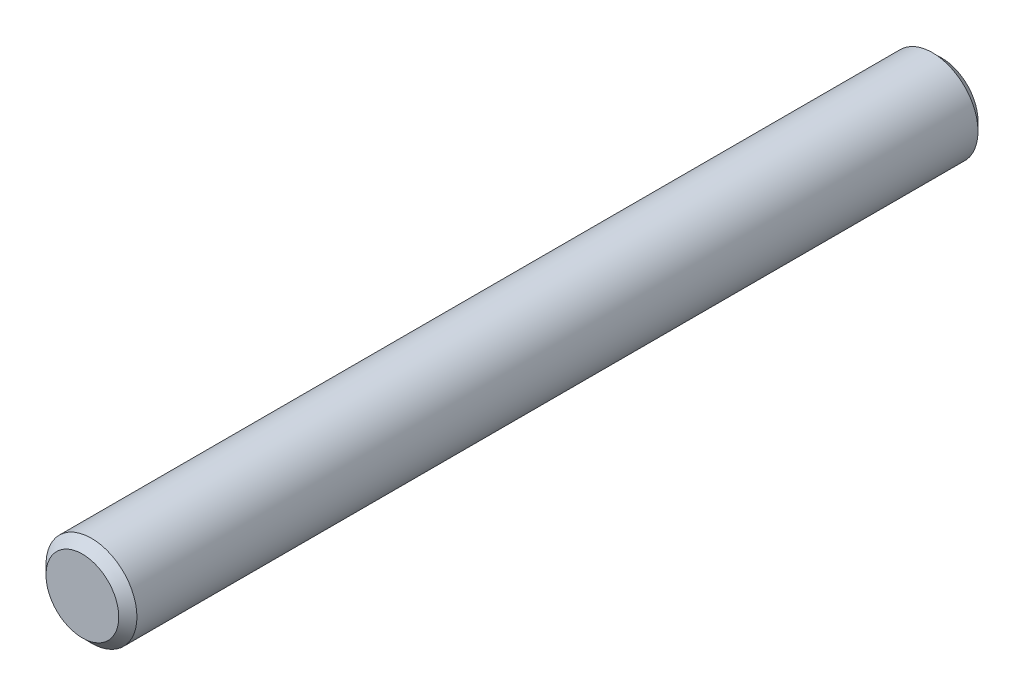
ISO-10303-21;
HEADER;
FILE_DESCRIPTION(('STEP AP214'),'2;1');
FILE_NAME('part.step','',(''),(''),'','','');
FILE_SCHEMA(('AUTOMOTIVE_DESIGN { 1 0 10303 214 1 1 1 1 }'));
ENDSEC;
DATA;
#1=APPLICATION_CONTEXT('core data for automotive mechanical design processes');
#2=APPLICATION_PROTOCOL_DEFINITION('international standard','automotive_design',2000,#1);
#3=PRODUCT_CONTEXT('',#1,'mechanical');
#4=PRODUCT('Part','Part','',(#3));
#5=PRODUCT_RELATED_PRODUCT_CATEGORY('part','',(#4));
#6=PRODUCT_DEFINITION_FORMATION('','',#4);
#7=PRODUCT_DEFINITION_CONTEXT('part definition',#1,'design');
#8=PRODUCT_DEFINITION('design','',#6,#7);
#9=PRODUCT_DEFINITION_SHAPE('','',#8);
#10=(LENGTH_UNIT() NAMED_UNIT(*) SI_UNIT(.MILLI.,.METRE.));
#11=(NAMED_UNIT(*) PLANE_ANGLE_UNIT() SI_UNIT($,.RADIAN.));
#12=(NAMED_UNIT(*) SI_UNIT($,.STERADIAN.) SOLID_ANGLE_UNIT());
#13=UNCERTAINTY_MEASURE_WITH_UNIT(LENGTH_MEASURE(1.E-05),#10,'distance_accuracy_value','');
#14=(GEOMETRIC_REPRESENTATION_CONTEXT(3) GLOBAL_UNCERTAINTY_ASSIGNED_CONTEXT((#13)) GLOBAL_UNIT_ASSIGNED_CONTEXT((#10,
#11,#12)) REPRESENTATION_CONTEXT('',''));
#15=CARTESIAN_POINT('',(0.,0.,0.));
#16=DIRECTION('',(0.,0.,1.));
#17=DIRECTION('',(1.,0.,0.));
#18=AXIS2_PLACEMENT_3D('',#15,#16,#17);
#19=CARTESIAN_POINT('',(0.,0.,75.));
#20=DIRECTION('',(0.,0.,-1.));
#21=DIRECTION('',(-1.,0.,0.));
#22=AXIS2_PLACEMENT_3D('',#19,#20,#21);
#23=CYLINDRICAL_SURFACE('',#22,7.9375);
#24=CARTESIAN_POINT('',(0.,0.,-73.4125));
#25=DIRECTION('',(0.,0.,1.));
#26=DIRECTION('',(1.,0.,0.));
#27=AXIS2_PLACEMENT_3D('',#24,#25,#26);
#28=CIRCLE('',#27,7.9375);
#29=CARTESIAN_POINT('',(7.9375,0.,-73.4125));
#30=VERTEX_POINT('',#29);
#31=EDGE_CURVE('E53',#30,#30,#28,.T.);
#32=ORIENTED_EDGE('',*,*,#31,.T.);
#33=EDGE_LOOP('',(#32));
#34=FACE_BOUND('',#33,.T.);
#35=CARTESIAN_POINT('',(0.,0.,73.4125));
#36=DIRECTION('',(0.,0.,1.));
#37=DIRECTION('',(1.,0.,0.));
#38=AXIS2_PLACEMENT_3D('',#35,#36,#37);
#39=CIRCLE('',#38,7.9375);
#40=CARTESIAN_POINT('',(7.9375,0.,73.4125));
#41=VERTEX_POINT('',#40);
#42=EDGE_CURVE('E57',#41,#41,#39,.F.);
#43=ORIENTED_EDGE('',*,*,#42,.T.);
#44=EDGE_LOOP('',(#43));
#45=FACE_BOUND('',#44,.T.);
#46=ADVANCED_FACE('F42',(#34,#45),#23,.T.);
#47=CARTESIAN_POINT('',(0.,0.,75.));
#48=DIRECTION('',(0.,0.,1.));
#49=DIRECTION('',(1.,0.,0.));
#50=AXIS2_PLACEMENT_3D('',#47,#48,#49);
#51=PLANE('',#50);
#52=CARTESIAN_POINT('',(0.,0.,75.));
#53=DIRECTION('',(0.,0.,1.));
#54=DIRECTION('',(1.,0.,0.));
#55=AXIS2_PLACEMENT_3D('',#52,#53,#54);
#56=CIRCLE('',#55,6.34999999999997);
#57=CARTESIAN_POINT('',(6.34999999999997,0.,75.));
#58=VERTEX_POINT('',#57);
#59=EDGE_CURVE('E10',#58,#58,#56,.T.);
#60=ORIENTED_EDGE('',*,*,#59,.T.);
#61=EDGE_LOOP('',(#60));
#62=FACE_BOUND('',#61,.T.);
#63=ADVANCED_FACE('F73',(#62),#51,.T.);
#64=CARTESIAN_POINT('',(0.,0.,-75.));
#65=DIRECTION('',(0.,0.,1.));
#66=DIRECTION('',(1.,0.,0.));
#67=AXIS2_PLACEMENT_3D('',#64,#65,#66);
#68=PLANE('',#67);
#69=CARTESIAN_POINT('',(0.,0.,-75.));
#70=DIRECTION('',(0.,0.,1.));
#71=DIRECTION('',(1.,0.,0.));
#72=AXIS2_PLACEMENT_3D('',#69,#70,#71);
#73=CIRCLE('',#72,6.35000000000001);
#74=CARTESIAN_POINT('',(6.35000000000001,0.,-75.));
#75=VERTEX_POINT('',#74);
#76=EDGE_CURVE('E49',#75,#75,#73,.F.);
#77=ORIENTED_EDGE('',*,*,#76,.T.);
#78=EDGE_LOOP('',(#77));
#79=FACE_BOUND('',#78,.T.);
#80=ADVANCED_FACE('F70',(#79),#68,.F.);
#81=CARTESIAN_POINT('',(0.,0.,-73.4125));
#82=DIRECTION('',(0.,0.,1.));
#83=DIRECTION('',(1.,0.,0.));
#84=AXIS2_PLACEMENT_3D('',#81,#82,#83);
#85=CONICAL_SURFACE('',#84,7.9375,0.785398163397448);
#86=ORIENTED_EDGE('',*,*,#76,.F.);
#87=EDGE_LOOP('',(#86));
#88=FACE_BOUND('',#87,.T.);
#89=ORIENTED_EDGE('',*,*,#31,.F.);
#90=EDGE_LOOP('',(#89));
#91=FACE_BOUND('',#90,.T.);
#92=ADVANCED_FACE('F66',(#88,#91),#85,.T.);
#93=CARTESIAN_POINT('',(0.,0.,75.));
#94=DIRECTION('',(0.,0.,-1.));
#95=DIRECTION('',(-1.,0.,0.));
#96=AXIS2_PLACEMENT_3D('',#93,#94,#95);
#97=CONICAL_SURFACE('',#96,6.34999999999997,0.785398163397448);
#98=ORIENTED_EDGE('',*,*,#42,.F.);
#99=EDGE_LOOP('',(#98));
#100=FACE_BOUND('',#99,.T.);
#101=ORIENTED_EDGE('',*,*,#59,.F.);
#102=EDGE_LOOP('',(#101));
#103=FACE_BOUND('',#102,.T.);
#104=ADVANCED_FACE('F44',(#100,#103),#97,.T.);
#105=CLOSED_SHELL('',(#46,#63,#80,#92,#104));
#106=MANIFOLD_SOLID_BREP('B2',#105);
#107=ADVANCED_BREP_SHAPE_REPRESENTATION('',(#18,#106),#14);
#108=SHAPE_DEFINITION_REPRESENTATION(#9,#107);
ENDSEC;
END-ISO-10303-21;
